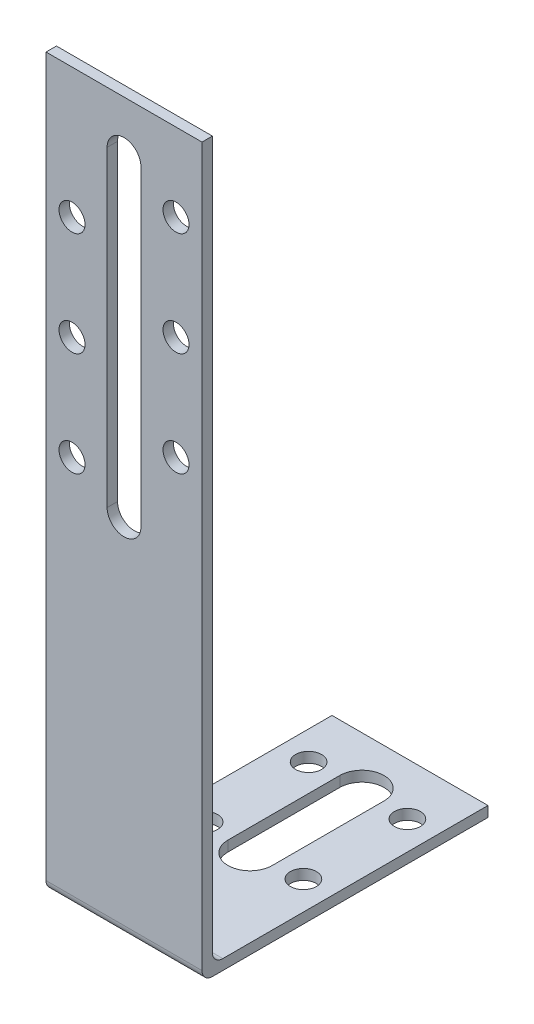
ISO-10303-21;
HEADER;
FILE_DESCRIPTION(('STEP AP214'),'2;1');
FILE_NAME('part.step','',(''),(''),'','','');
FILE_SCHEMA(('AUTOMOTIVE_DESIGN { 1 0 10303 214 1 1 1 1 }'));
ENDSEC;
DATA;
#1=APPLICATION_CONTEXT('core data for automotive mechanical design processes');
#2=APPLICATION_PROTOCOL_DEFINITION('international standard','automotive_design',2000,#1);
#3=PRODUCT_CONTEXT('',#1,'mechanical');
#4=PRODUCT('Part','Part','',(#3));
#5=PRODUCT_RELATED_PRODUCT_CATEGORY('part','',(#4));
#6=PRODUCT_DEFINITION_FORMATION('','',#4);
#7=PRODUCT_DEFINITION_CONTEXT('part definition',#1,'design');
#8=PRODUCT_DEFINITION('design','',#6,#7);
#9=PRODUCT_DEFINITION_SHAPE('','',#8);
#10=(LENGTH_UNIT() NAMED_UNIT(*) SI_UNIT(.MILLI.,.METRE.));
#11=(NAMED_UNIT(*) PLANE_ANGLE_UNIT() SI_UNIT($,.RADIAN.));
#12=(NAMED_UNIT(*) SI_UNIT($,.STERADIAN.) SOLID_ANGLE_UNIT());
#13=UNCERTAINTY_MEASURE_WITH_UNIT(LENGTH_MEASURE(1.E-05),#10,'distance_accuracy_value','');
#14=(GEOMETRIC_REPRESENTATION_CONTEXT(3) GLOBAL_UNCERTAINTY_ASSIGNED_CONTEXT((#13)) GLOBAL_UNIT_ASSIGNED_CONTEXT((#10,
#11,#12)) REPRESENTATION_CONTEXT('',''));
#15=CARTESIAN_POINT('',(0.,0.,0.));
#16=DIRECTION('',(0.,0.,1.));
#17=DIRECTION('',(1.,0.,0.));
#18=AXIS2_PLACEMENT_3D('',#15,#16,#17);
#19=CARTESIAN_POINT('',(15.,0.,-55.));
#20=DIRECTION('',(0.,1.,0.));
#21=DIRECTION('',(0.,0.,1.));
#22=AXIS2_PLACEMENT_3D('',#19,#20,#21);
#23=PLANE('',#22);
#24=CARTESIAN_POINT('',(9.5,0.,-45.));
#25=DIRECTION('',(0.,1.,0.));
#26=DIRECTION('',(0.,0.,1.));
#27=AXIS2_PLACEMENT_3D('',#24,#25,#26);
#28=CIRCLE('',#27,2.5);
#29=CARTESIAN_POINT('',(9.5,0.,-42.5));
#30=VERTEX_POINT('',#29);
#31=EDGE_CURVE('E195',#30,#30,#28,.F.);
#32=ORIENTED_EDGE('',*,*,#31,.F.);
#33=EDGE_LOOP('',(#32));
#34=FACE_BOUND('',#33,.T.);
#35=CARTESIAN_POINT('',(-9.49999999999999,0.,-25.));
#36=DIRECTION('',(0.,1.,0.));
#37=DIRECTION('',(0.,0.,1.));
#38=AXIS2_PLACEMENT_3D('',#35,#36,#37);
#39=CIRCLE('',#38,2.5);
#40=CARTESIAN_POINT('',(-9.49999999999999,0.,-22.5));
#41=VERTEX_POINT('',#40);
#42=EDGE_CURVE('E185',#41,#41,#39,.F.);
#43=ORIENTED_EDGE('',*,*,#42,.F.);
#44=EDGE_LOOP('',(#43));
#45=FACE_BOUND('',#44,.T.);
#46=CARTESIAN_POINT('',(0.,0.,-24.25));
#47=DIRECTION('',(0.,1.,0.));
#48=DIRECTION('',(0.,0.,1.));
#49=AXIS2_PLACEMENT_3D('',#46,#47,#48);
#50=CIRCLE('',#49,4.25);
#51=CARTESIAN_POINT('',(4.25,0.,-24.25));
#52=VERTEX_POINT('',#51);
#53=CARTESIAN_POINT('',(-4.25,0.,-24.25));
#54=VERTEX_POINT('',#53);
#55=EDGE_CURVE('E208',#52,#54,#50,.F.);
#56=ORIENTED_EDGE('',*,*,#55,.F.);
#57=DIRECTION('',(0.,0.,1.));
#58=VECTOR('',#57,1.);
#59=CARTESIAN_POINT('',(4.25,0.,0.));
#60=LINE('',#59,#58);
#61=CARTESIAN_POINT('',(4.25,0.,-45.75));
#62=VERTEX_POINT('',#61);
#63=EDGE_CURVE('E211',#62,#52,#60,.T.);
#64=ORIENTED_EDGE('',*,*,#63,.F.);
#65=CARTESIAN_POINT('',(0.,0.,-45.75));
#66=DIRECTION('',(0.,1.,0.));
#67=DIRECTION('',(0.,0.,1.));
#68=AXIS2_PLACEMENT_3D('',#65,#66,#67);
#69=CIRCLE('',#68,4.25);
#70=CARTESIAN_POINT('',(-4.25,0.,-45.75));
#71=VERTEX_POINT('',#70);
#72=EDGE_CURVE('E228',#71,#62,#69,.F.);
#73=ORIENTED_EDGE('',*,*,#72,.F.);
#74=DIRECTION('',(0.,0.,1.));
#75=VECTOR('',#74,1.);
#76=CARTESIAN_POINT('',(-4.25,0.,0.));
#77=LINE('',#76,#75);
#78=EDGE_CURVE('E189',#71,#54,#77,.T.);
#79=ORIENTED_EDGE('',*,*,#78,.T.);
#80=EDGE_LOOP('',(#56,#64,#73,#79));
#81=FACE_BOUND('',#80,.T.);
#82=DIRECTION('',(0.,0.,-1.));
#83=VECTOR('',#82,1.);
#84=CARTESIAN_POINT('',(15.,0.,-55.));
#85=LINE('',#84,#83);
#86=CARTESIAN_POINT('',(15.,0.,-2.));
#87=VERTEX_POINT('',#86);
#88=CARTESIAN_POINT('',(15.,0.,-55.));
#89=VERTEX_POINT('',#88);
#90=EDGE_CURVE('E238',#87,#89,#85,.T.);
#91=ORIENTED_EDGE('',*,*,#90,.F.);
#92=DIRECTION('',(-1.,0.,0.));
#93=VECTOR('',#92,1.);
#94=CARTESIAN_POINT('',(15.,0.,-2.));
#95=LINE('',#94,#93);
#96=CARTESIAN_POINT('',(-15.,0.,-2.));
#97=VERTEX_POINT('',#96);
#98=EDGE_CURVE('E277',#87,#97,#95,.T.);
#99=ORIENTED_EDGE('',*,*,#98,.T.);
#100=DIRECTION('',(0.,0.,-1.));
#101=VECTOR('',#100,1.);
#102=CARTESIAN_POINT('',(-15.,0.,-55.));
#103=LINE('',#102,#101);
#104=CARTESIAN_POINT('',(-15.,0.,-55.));
#105=VERTEX_POINT('',#104);
#106=EDGE_CURVE('E237',#97,#105,#103,.T.);
#107=ORIENTED_EDGE('',*,*,#106,.T.);
#108=DIRECTION('',(-1.,0.,0.));
#109=VECTOR('',#108,1.);
#110=CARTESIAN_POINT('',(15.,0.,-55.));
#111=LINE('',#110,#109);
#112=EDGE_CURVE('E274',#89,#105,#111,.T.);
#113=ORIENTED_EDGE('',*,*,#112,.F.);
#114=EDGE_LOOP('',(#91,#99,#107,#113));
#115=FACE_BOUND('',#114,.T.);
#116=CARTESIAN_POINT('',(-9.49999999999999,0.,-45.));
#117=DIRECTION('',(0.,1.,0.));
#118=DIRECTION('',(0.,0.,1.));
#119=AXIS2_PLACEMENT_3D('',#116,#117,#118);
#120=CIRCLE('',#119,2.5);
#121=CARTESIAN_POINT('',(-9.49999999999999,0.,-42.5));
#122=VERTEX_POINT('',#121);
#123=EDGE_CURVE('E192',#122,#122,#120,.T.);
#124=ORIENTED_EDGE('',*,*,#123,.T.);
#125=EDGE_LOOP('',(#124));
#126=FACE_BOUND('',#125,.T.);
#127=CARTESIAN_POINT('',(9.5,0.,-25.));
#128=DIRECTION('',(0.,1.,0.));
#129=DIRECTION('',(0.,0.,1.));
#130=AXIS2_PLACEMENT_3D('',#127,#128,#129);
#131=CIRCLE('',#130,2.5);
#132=CARTESIAN_POINT('',(9.5,0.,-22.5));
#133=VERTEX_POINT('',#132);
#134=EDGE_CURVE('E159',#133,#133,#131,.T.);
#135=ORIENTED_EDGE('',*,*,#134,.T.);
#136=EDGE_LOOP('',(#135));
#137=FACE_BOUND('',#136,.T.);
#138=ADVANCED_FACE('F33',(#34,#45,#81,#115,#126,#137),#23,.F.);
#139=CARTESIAN_POINT('',(15.,2.,-2.00000000000001));
#140=DIRECTION('',(0.,-1.,0.));
#141=DIRECTION('',(0.,0.,-1.));
#142=AXIS2_PLACEMENT_3D('',#139,#140,#141);
#143=PLANE('',#142);
#144=CARTESIAN_POINT('',(9.5,2.,-45.));
#145=DIRECTION('',(0.,1.,0.));
#146=DIRECTION('',(0.,0.,1.));
#147=AXIS2_PLACEMENT_3D('',#144,#145,#146);
#148=CIRCLE('',#147,2.5);
#149=CARTESIAN_POINT('',(9.5,2.,-42.5));
#150=VERTEX_POINT('',#149);
#151=EDGE_CURVE('E196',#150,#150,#148,.T.);
#152=ORIENTED_EDGE('',*,*,#151,.F.);
#153=EDGE_LOOP('',(#152));
#154=FACE_BOUND('',#153,.T.);
#155=CARTESIAN_POINT('',(-9.49999999999999,2.,-25.));
#156=DIRECTION('',(0.,1.,0.));
#157=DIRECTION('',(0.,0.,1.));
#158=AXIS2_PLACEMENT_3D('',#155,#156,#157);
#159=CIRCLE('',#158,2.5);
#160=CARTESIAN_POINT('',(-9.49999999999999,2.,-22.5));
#161=VERTEX_POINT('',#160);
#162=EDGE_CURVE('E182',#161,#161,#159,.T.);
#163=ORIENTED_EDGE('',*,*,#162,.F.);
#164=EDGE_LOOP('',(#163));
#165=FACE_BOUND('',#164,.T.);
#166=CARTESIAN_POINT('',(0.,2.,-45.75));
#167=DIRECTION('',(0.,1.,0.));
#168=DIRECTION('',(0.,0.,1.));
#169=AXIS2_PLACEMENT_3D('',#166,#167,#168);
#170=CIRCLE('',#169,4.25);
#171=CARTESIAN_POINT('',(4.25,2.,-45.75));
#172=VERTEX_POINT('',#171);
#173=CARTESIAN_POINT('',(-4.25,2.,-45.75));
#174=VERTEX_POINT('',#173);
#175=EDGE_CURVE('E216',#172,#174,#170,.T.);
#176=ORIENTED_EDGE('',*,*,#175,.F.);
#177=DIRECTION('',(0.,0.,-1.));
#178=VECTOR('',#177,1.);
#179=CARTESIAN_POINT('',(4.25,2.,0.));
#180=LINE('',#179,#178);
#181=CARTESIAN_POINT('',(4.25,2.,-24.25));
#182=VERTEX_POINT('',#181);
#183=EDGE_CURVE('E214',#182,#172,#180,.T.);
#184=ORIENTED_EDGE('',*,*,#183,.F.);
#185=CARTESIAN_POINT('',(0.,2.,-24.25));
#186=DIRECTION('',(0.,1.,0.));
#187=DIRECTION('',(0.,0.,1.));
#188=AXIS2_PLACEMENT_3D('',#185,#186,#187);
#189=CIRCLE('',#188,4.25);
#190=CARTESIAN_POINT('',(-4.25,2.,-24.25));
#191=VERTEX_POINT('',#190);
#192=EDGE_CURVE('E222',#191,#182,#189,.T.);
#193=ORIENTED_EDGE('',*,*,#192,.F.);
#194=DIRECTION('',(0.,0.,-1.));
#195=VECTOR('',#194,1.);
#196=CARTESIAN_POINT('',(-4.25,2.,0.));
#197=LINE('',#196,#195);
#198=EDGE_CURVE('E219',#191,#174,#197,.T.);
#199=ORIENTED_EDGE('',*,*,#198,.T.);
#200=EDGE_LOOP('',(#176,#184,#193,#199));
#201=FACE_BOUND('',#200,.T.);
#202=DIRECTION('',(0.,0.,1.));
#203=VECTOR('',#202,1.);
#204=CARTESIAN_POINT('',(-15.,2.,-2.00000000000001));
#205=LINE('',#204,#203);
#206=CARTESIAN_POINT('',(-15.,2.,-55.));
#207=VERTEX_POINT('',#206);
#208=CARTESIAN_POINT('',(-15.,2.,-4.00000000000001));
#209=VERTEX_POINT('',#208);
#210=EDGE_CURVE('E257',#207,#209,#205,.T.);
#211=ORIENTED_EDGE('',*,*,#210,.T.);
#212=DIRECTION('',(-1.,0.,0.));
#213=VECTOR('',#212,1.);
#214=CARTESIAN_POINT('',(15.,2.,-4.00000000000001));
#215=LINE('',#214,#213);
#216=CARTESIAN_POINT('',(15.,2.,-4.00000000000001));
#217=VERTEX_POINT('',#216);
#218=EDGE_CURVE('E289',#209,#217,#215,.F.);
#219=ORIENTED_EDGE('',*,*,#218,.T.);
#220=DIRECTION('',(0.,0.,1.));
#221=VECTOR('',#220,1.);
#222=CARTESIAN_POINT('',(15.,2.,-2.00000000000001));
#223=LINE('',#222,#221);
#224=CARTESIAN_POINT('',(15.,2.,-55.));
#225=VERTEX_POINT('',#224);
#226=EDGE_CURVE('E243',#225,#217,#223,.T.);
#227=ORIENTED_EDGE('',*,*,#226,.F.);
#228=DIRECTION('',(-1.,0.,0.));
#229=VECTOR('',#228,1.);
#230=CARTESIAN_POINT('',(15.,2.,-55.));
#231=LINE('',#230,#229);
#232=EDGE_CURVE('E271',#225,#207,#231,.T.);
#233=ORIENTED_EDGE('',*,*,#232,.T.);
#234=EDGE_LOOP('',(#211,#219,#227,#233));
#235=FACE_BOUND('',#234,.T.);
#236=CARTESIAN_POINT('',(-9.49999999999999,2.,-45.));
#237=DIRECTION('',(0.,1.,0.));
#238=DIRECTION('',(0.,0.,1.));
#239=AXIS2_PLACEMENT_3D('',#236,#237,#238);
#240=CIRCLE('',#239,2.5);
#241=CARTESIAN_POINT('',(-9.49999999999999,2.,-42.5));
#242=VERTEX_POINT('',#241);
#243=EDGE_CURVE('E186',#242,#242,#240,.F.);
#244=ORIENTED_EDGE('',*,*,#243,.T.);
#245=EDGE_LOOP('',(#244));
#246=FACE_BOUND('',#245,.T.);
#247=CARTESIAN_POINT('',(9.5,2.,-25.));
#248=DIRECTION('',(0.,1.,0.));
#249=DIRECTION('',(0.,0.,1.));
#250=AXIS2_PLACEMENT_3D('',#247,#248,#249);
#251=CIRCLE('',#250,2.5);
#252=CARTESIAN_POINT('',(9.5,2.,-22.5));
#253=VERTEX_POINT('',#252);
#254=EDGE_CURVE('E199',#253,#253,#251,.F.);
#255=ORIENTED_EDGE('',*,*,#254,.T.);
#256=EDGE_LOOP('',(#255));
#257=FACE_BOUND('',#256,.T.);
#258=ADVANCED_FACE('F301',(#154,#165,#201,#235,#246,#257),#143,.F.);
#259=CARTESIAN_POINT('',(15.,2.,-55.));
#260=DIRECTION('',(0.,0.,1.));
#261=DIRECTION('',(1.,0.,0.));
#262=AXIS2_PLACEMENT_3D('',#259,#260,#261);
#263=PLANE('',#262);
#264=DIRECTION('',(0.,1.,0.));
#265=VECTOR('',#264,1.);
#266=CARTESIAN_POINT('',(-15.,2.,-55.));
#267=LINE('',#266,#265);
#268=EDGE_CURVE('E255',#105,#207,#267,.T.);
#269=ORIENTED_EDGE('',*,*,#268,.T.);
#270=ORIENTED_EDGE('',*,*,#232,.F.);
#271=DIRECTION('',(0.,1.,0.));
#272=VECTOR('',#271,1.);
#273=CARTESIAN_POINT('',(15.,2.,-55.));
#274=LINE('',#273,#272);
#275=EDGE_CURVE('E240',#89,#225,#274,.T.);
#276=ORIENTED_EDGE('',*,*,#275,.F.);
#277=ORIENTED_EDGE('',*,*,#112,.T.);
#278=EDGE_LOOP('',(#269,#270,#276,#277));
#279=FACE_BOUND('',#278,.T.);
#280=ADVANCED_FACE('F329',(#279),#263,.F.);
#281=CARTESIAN_POINT('',(15.,140.,-2.));
#282=DIRECTION('',(0.,0.,1.));
#283=DIRECTION('',(0.,-1.,0.));
#284=AXIS2_PLACEMENT_3D('',#281,#282,#283);
#285=PLANE('',#284);
#286=CARTESIAN_POINT('',(-10.,115.,-2.));
#287=DIRECTION('',(0.,0.,-1.));
#288=DIRECTION('',(0.,1.,0.));
#289=AXIS2_PLACEMENT_3D('',#286,#287,#288);
#290=CIRCLE('',#289,2.5);
#291=CARTESIAN_POINT('',(-10.,117.5,-2.));
#292=VERTEX_POINT('',#291);
#293=EDGE_CURVE('E594',#292,#292,#290,.T.);
#294=ORIENTED_EDGE('',*,*,#293,.F.);
#295=EDGE_LOOP('',(#294));
#296=FACE_BOUND('',#295,.T.);
#297=CARTESIAN_POINT('',(10.,85.,-2.));
#298=DIRECTION('',(0.,0.,-1.));
#299=DIRECTION('',(0.,1.,0.));
#300=AXIS2_PLACEMENT_3D('',#297,#298,#299);
#301=CIRCLE('',#300,2.5);
#302=CARTESIAN_POINT('',(10.,87.5,-2.));
#303=VERTEX_POINT('',#302);
#304=EDGE_CURVE('E598',#303,#303,#301,.T.);
#305=ORIENTED_EDGE('',*,*,#304,.F.);
#306=EDGE_LOOP('',(#305));
#307=FACE_BOUND('',#306,.T.);
#308=CARTESIAN_POINT('',(10.,105.,-2.));
#309=DIRECTION('',(0.,0.,-1.));
#310=DIRECTION('',(0.,1.,0.));
#311=AXIS2_PLACEMENT_3D('',#308,#309,#310);
#312=CIRCLE('',#311,2.5);
#313=CARTESIAN_POINT('',(10.,107.5,-2.));
#314=VERTEX_POINT('',#313);
#315=EDGE_CURVE('E614',#314,#314,#312,.T.);
#316=ORIENTED_EDGE('',*,*,#315,.F.);
#317=EDGE_LOOP('',(#316));
#318=FACE_BOUND('',#317,.T.);
#319=CARTESIAN_POINT('',(10.,125.,-2.));
#320=DIRECTION('',(0.,0.,-1.));
#321=DIRECTION('',(0.,1.,0.));
#322=AXIS2_PLACEMENT_3D('',#319,#320,#321);
#323=CIRCLE('',#322,2.5);
#324=CARTESIAN_POINT('',(10.,127.5,-2.));
#325=VERTEX_POINT('',#324);
#326=EDGE_CURVE('E607',#325,#325,#323,.T.);
#327=ORIENTED_EDGE('',*,*,#326,.F.);
#328=EDGE_LOOP('',(#327));
#329=FACE_BOUND('',#328,.T.);
#330=CARTESIAN_POINT('',(-10.,95.,-2.));
#331=DIRECTION('',(0.,0.,-1.));
#332=DIRECTION('',(0.,1.,0.));
#333=AXIS2_PLACEMENT_3D('',#330,#331,#332);
#334=CIRCLE('',#333,2.5);
#335=CARTESIAN_POINT('',(-10.,97.5,-2.));
#336=VERTEX_POINT('',#335);
#337=EDGE_CURVE('E631',#336,#336,#334,.T.);
#338=ORIENTED_EDGE('',*,*,#337,.F.);
#339=EDGE_LOOP('',(#338));
#340=FACE_BOUND('',#339,.T.);
#341=CARTESIAN_POINT('',(-10.,75.,-2.));
#342=DIRECTION('',(0.,0.,-1.));
#343=DIRECTION('',(0.,1.,0.));
#344=AXIS2_PLACEMENT_3D('',#341,#342,#343);
#345=CIRCLE('',#344,2.5);
#346=CARTESIAN_POINT('',(-10.,77.5,-2.));
#347=VERTEX_POINT('',#346);
#348=EDGE_CURVE('E632',#347,#347,#345,.T.);
#349=ORIENTED_EDGE('',*,*,#348,.F.);
#350=EDGE_LOOP('',(#349));
#351=FACE_BOUND('',#350,.T.);
#352=DIRECTION('',(0.,-1.,0.));
#353=VECTOR('',#352,1.);
#354=CARTESIAN_POINT('',(3.25,130.,-2.));
#355=LINE('',#354,#353);
#356=CARTESIAN_POINT('',(3.25,130.,-2.));
#357=VERTEX_POINT('',#356);
#358=CARTESIAN_POINT('',(3.25,70.,-2.));
#359=VERTEX_POINT('',#358);
#360=EDGE_CURVE('E167',#357,#359,#355,.T.);
#361=ORIENTED_EDGE('',*,*,#360,.F.);
#362=CARTESIAN_POINT('',(0.,130.,-2.));
#363=DIRECTION('',(0.,0.,-1.));
#364=DIRECTION('',(0.,1.,0.));
#365=AXIS2_PLACEMENT_3D('',#362,#363,#364);
#366=CIRCLE('',#365,3.25);
#367=CARTESIAN_POINT('',(-3.24999999999999,130.,-2.));
#368=VERTEX_POINT('',#367);
#369=EDGE_CURVE('E48',#368,#357,#366,.T.);
#370=ORIENTED_EDGE('',*,*,#369,.F.);
#371=DIRECTION('',(0.,1.,0.));
#372=VECTOR('',#371,1.);
#373=CARTESIAN_POINT('',(-3.24999999999999,130.,-2.));
#374=LINE('',#373,#372);
#375=CARTESIAN_POINT('',(-3.25,70.,-2.));
#376=VERTEX_POINT('',#375);
#377=EDGE_CURVE('E153',#376,#368,#374,.T.);
#378=ORIENTED_EDGE('',*,*,#377,.F.);
#379=CARTESIAN_POINT('',(0.,70.,-2.));
#380=DIRECTION('',(0.,0.,-1.));
#381=DIRECTION('',(0.,1.,0.));
#382=AXIS2_PLACEMENT_3D('',#379,#380,#381);
#383=CIRCLE('',#382,3.25);
#384=EDGE_CURVE('E173',#359,#376,#383,.T.);
#385=ORIENTED_EDGE('',*,*,#384,.F.);
#386=EDGE_LOOP('',(#361,#370,#378,#385));
#387=FACE_BOUND('',#386,.T.);
#388=DIRECTION('',(0.,1.,0.));
#389=VECTOR('',#388,1.);
#390=CARTESIAN_POINT('',(15.,140.,-2.));
#391=LINE('',#390,#389);
#392=CARTESIAN_POINT('',(15.,4.,-2.00000000000001));
#393=VERTEX_POINT('',#392);
#394=CARTESIAN_POINT('',(15.,140.,-2.));
#395=VERTEX_POINT('',#394);
#396=EDGE_CURVE('E246',#393,#395,#391,.T.);
#397=ORIENTED_EDGE('',*,*,#396,.F.);
#398=DIRECTION('',(-1.,0.,0.));
#399=VECTOR('',#398,1.);
#400=CARTESIAN_POINT('',(-15.,4.,-2.00000000000001));
#401=LINE('',#400,#399);
#402=CARTESIAN_POINT('',(-15.,4.,-2.00000000000001));
#403=VERTEX_POINT('',#402);
#404=EDGE_CURVE('E286',#393,#403,#401,.T.);
#405=ORIENTED_EDGE('',*,*,#404,.T.);
#406=DIRECTION('',(0.,1.,0.));
#407=VECTOR('',#406,1.);
#408=CARTESIAN_POINT('',(-15.,140.,-2.));
#409=LINE('',#408,#407);
#410=CARTESIAN_POINT('',(-15.,140.,-2.));
#411=VERTEX_POINT('',#410);
#412=EDGE_CURVE('E260',#403,#411,#409,.T.);
#413=ORIENTED_EDGE('',*,*,#412,.T.);
#414=DIRECTION('',(-1.,0.,0.));
#415=VECTOR('',#414,1.);
#416=CARTESIAN_POINT('',(15.,140.,-2.));
#417=LINE('',#416,#415);
#418=EDGE_CURVE('E268',#395,#411,#417,.T.);
#419=ORIENTED_EDGE('',*,*,#418,.F.);
#420=EDGE_LOOP('',(#397,#405,#413,#419));
#421=FACE_BOUND('',#420,.T.);
#422=ADVANCED_FACE('F311',(#296,#307,#318,#329,#340,#351,#387,#421),#285,.F.);
#423=CARTESIAN_POINT('',(15.,140.,0.));
#424=DIRECTION('',(0.,-1.,0.));
#425=DIRECTION('',(0.,0.,-1.));
#426=AXIS2_PLACEMENT_3D('',#423,#424,#425);
#427=PLANE('',#426);
#428=DIRECTION('',(0.,0.,1.));
#429=VECTOR('',#428,1.);
#430=CARTESIAN_POINT('',(-15.,140.,0.));
#431=LINE('',#430,#429);
#432=CARTESIAN_POINT('',(-15.,140.,0.));
#433=VERTEX_POINT('',#432);
#434=EDGE_CURVE('E262',#411,#433,#431,.T.);
#435=ORIENTED_EDGE('',*,*,#434,.T.);
#436=DIRECTION('',(-1.,0.,0.));
#437=VECTOR('',#436,1.);
#438=CARTESIAN_POINT('',(15.,140.,0.));
#439=LINE('',#438,#437);
#440=CARTESIAN_POINT('',(15.,140.,0.));
#441=VERTEX_POINT('',#440);
#442=EDGE_CURVE('E253',#441,#433,#439,.T.);
#443=ORIENTED_EDGE('',*,*,#442,.F.);
#444=DIRECTION('',(0.,0.,1.));
#445=VECTOR('',#444,1.);
#446=CARTESIAN_POINT('',(15.,140.,0.));
#447=LINE('',#446,#445);
#448=EDGE_CURVE('E248',#395,#441,#447,.T.);
#449=ORIENTED_EDGE('',*,*,#448,.F.);
#450=ORIENTED_EDGE('',*,*,#418,.T.);
#451=EDGE_LOOP('',(#435,#443,#449,#450));
#452=FACE_BOUND('',#451,.T.);
#453=ADVANCED_FACE('F315',(#452),#427,.F.);
#454=CARTESIAN_POINT('',(15.,0.,0.));
#455=DIRECTION('',(0.,0.,-1.));
#456=DIRECTION('',(-1.,0.,0.));
#457=AXIS2_PLACEMENT_3D('',#454,#455,#456);
#458=PLANE('',#457);
#459=CARTESIAN_POINT('',(-10.,115.,0.));
#460=DIRECTION('',(0.,0.,-1.));
#461=DIRECTION('',(-1.,0.,0.));
#462=AXIS2_PLACEMENT_3D('',#459,#460,#461);
#463=CIRCLE('',#462,2.5);
#464=CARTESIAN_POINT('',(-12.5,115.,0.));
#465=VERTEX_POINT('',#464);
#466=EDGE_CURVE('E597',#465,#465,#463,.F.);
#467=ORIENTED_EDGE('',*,*,#466,.F.);
#468=EDGE_LOOP('',(#467));
#469=FACE_BOUND('',#468,.T.);
#470=CARTESIAN_POINT('',(10.,85.,0.));
#471=DIRECTION('',(0.,0.,-1.));
#472=DIRECTION('',(-1.,0.,0.));
#473=AXIS2_PLACEMENT_3D('',#470,#471,#472);
#474=CIRCLE('',#473,2.5);
#475=CARTESIAN_POINT('',(7.5,85.,0.));
#476=VERTEX_POINT('',#475);
#477=EDGE_CURVE('E601',#476,#476,#474,.F.);
#478=ORIENTED_EDGE('',*,*,#477,.F.);
#479=EDGE_LOOP('',(#478));
#480=FACE_BOUND('',#479,.T.);
#481=CARTESIAN_POINT('',(10.,105.,0.));
#482=DIRECTION('',(0.,0.,-1.));
#483=DIRECTION('',(-1.,0.,0.));
#484=AXIS2_PLACEMENT_3D('',#481,#482,#483);
#485=CIRCLE('',#484,2.5);
#486=CARTESIAN_POINT('',(7.5,105.,0.));
#487=VERTEX_POINT('',#486);
#488=EDGE_CURVE('E611',#487,#487,#485,.F.);
#489=ORIENTED_EDGE('',*,*,#488,.F.);
#490=EDGE_LOOP('',(#489));
#491=FACE_BOUND('',#490,.T.);
#492=CARTESIAN_POINT('',(10.,125.,0.));
#493=DIRECTION('',(0.,0.,-1.));
#494=DIRECTION('',(-1.,0.,0.));
#495=AXIS2_PLACEMENT_3D('',#492,#493,#494);
#496=CIRCLE('',#495,2.5);
#497=CARTESIAN_POINT('',(7.5,125.,0.));
#498=VERTEX_POINT('',#497);
#499=EDGE_CURVE('E610',#498,#498,#496,.F.);
#500=ORIENTED_EDGE('',*,*,#499,.F.);
#501=EDGE_LOOP('',(#500));
#502=FACE_BOUND('',#501,.T.);
#503=CARTESIAN_POINT('',(-10.,95.,0.));
#504=DIRECTION('',(0.,0.,-1.));
#505=DIRECTION('',(-1.,0.,0.));
#506=AXIS2_PLACEMENT_3D('',#503,#504,#505);
#507=CIRCLE('',#506,2.5);
#508=CARTESIAN_POINT('',(-12.5,95.,0.));
#509=VERTEX_POINT('',#508);
#510=EDGE_CURVE('E603',#509,#509,#507,.F.);
#511=ORIENTED_EDGE('',*,*,#510,.F.);
#512=EDGE_LOOP('',(#511));
#513=FACE_BOUND('',#512,.T.);
#514=CARTESIAN_POINT('',(-10.,75.,0.));
#515=DIRECTION('',(0.,0.,-1.));
#516=DIRECTION('',(-1.,0.,0.));
#517=AXIS2_PLACEMENT_3D('',#514,#515,#516);
#518=CIRCLE('',#517,2.5);
#519=CARTESIAN_POINT('',(-12.5,75.,0.));
#520=VERTEX_POINT('',#519);
#521=EDGE_CURVE('E629',#520,#520,#518,.F.);
#522=ORIENTED_EDGE('',*,*,#521,.F.);
#523=EDGE_LOOP('',(#522));
#524=FACE_BOUND('',#523,.T.);
#525=DIRECTION('',(0.,-1.,0.));
#526=VECTOR('',#525,1.);
#527=CARTESIAN_POINT('',(-3.24999999999999,130.,0.));
#528=LINE('',#527,#526);
#529=CARTESIAN_POINT('',(-3.24999999999999,130.,0.));
#530=VERTEX_POINT('',#529);
#531=CARTESIAN_POINT('',(-3.25,70.,0.));
#532=VERTEX_POINT('',#531);
#533=EDGE_CURVE('E165',#530,#532,#528,.T.);
#534=ORIENTED_EDGE('',*,*,#533,.F.);
#535=CARTESIAN_POINT('',(0.,130.,0.));
#536=DIRECTION('',(0.,0.,-1.));
#537=DIRECTION('',(-1.,0.,0.));
#538=AXIS2_PLACEMENT_3D('',#535,#536,#537);
#539=CIRCLE('',#538,3.25);
#540=CARTESIAN_POINT('',(3.25,130.,0.));
#541=VERTEX_POINT('',#540);
#542=EDGE_CURVE('E147',#541,#530,#539,.F.);
#543=ORIENTED_EDGE('',*,*,#542,.F.);
#544=DIRECTION('',(0.,1.,0.));
#545=VECTOR('',#544,1.);
#546=CARTESIAN_POINT('',(3.25,130.,0.));
#547=LINE('',#546,#545);
#548=CARTESIAN_POINT('',(3.25,70.,0.));
#549=VERTEX_POINT('',#548);
#550=EDGE_CURVE('E156',#549,#541,#547,.T.);
#551=ORIENTED_EDGE('',*,*,#550,.F.);
#552=CARTESIAN_POINT('',(0.,70.,0.));
#553=DIRECTION('',(0.,0.,-1.));
#554=DIRECTION('',(-1.,0.,0.));
#555=AXIS2_PLACEMENT_3D('',#552,#553,#554);
#556=CIRCLE('',#555,3.25);
#557=EDGE_CURVE('E56',#532,#549,#556,.F.);
#558=ORIENTED_EDGE('',*,*,#557,.F.);
#559=EDGE_LOOP('',(#534,#543,#551,#558));
#560=FACE_BOUND('',#559,.T.);
#561=DIRECTION('',(0.,-1.,0.));
#562=VECTOR('',#561,1.);
#563=CARTESIAN_POINT('',(-15.,0.,0.));
#564=LINE('',#563,#562);
#565=CARTESIAN_POINT('',(-15.,2.,0.));
#566=VERTEX_POINT('',#565);
#567=EDGE_CURVE('E241',#433,#566,#564,.T.);
#568=ORIENTED_EDGE('',*,*,#567,.T.);
#569=DIRECTION('',(-1.,0.,0.));
#570=VECTOR('',#569,1.);
#571=CARTESIAN_POINT('',(15.,2.,0.));
#572=LINE('',#571,#570);
#573=CARTESIAN_POINT('',(15.,2.,0.));
#574=VERTEX_POINT('',#573);
#575=EDGE_CURVE('E282',#566,#574,#572,.F.);
#576=ORIENTED_EDGE('',*,*,#575,.T.);
#577=DIRECTION('',(0.,-1.,0.));
#578=VECTOR('',#577,1.);
#579=CARTESIAN_POINT('',(15.,0.,0.));
#580=LINE('',#579,#578);
#581=EDGE_CURVE('E250',#441,#574,#580,.T.);
#582=ORIENTED_EDGE('',*,*,#581,.F.);
#583=ORIENTED_EDGE('',*,*,#442,.T.);
#584=EDGE_LOOP('',(#568,#576,#582,#583));
#585=FACE_BOUND('',#584,.T.);
#586=ADVANCED_FACE('F162',(#469,#480,#491,#502,#513,#524,#560,#585),#458,.F.);
#587=CARTESIAN_POINT('',(15.,0.,0.));
#588=DIRECTION('',(-1.,0.,0.));
#589=DIRECTION('',(0.,0.,1.));
#590=AXIS2_PLACEMENT_3D('',#587,#588,#589);
#591=PLANE('',#590);
#592=ORIENTED_EDGE('',*,*,#581,.T.);
#593=CARTESIAN_POINT('',(15.,2.,-2.));
#594=DIRECTION('',(-1.,0.,0.));
#595=DIRECTION('',(0.,0.,1.));
#596=AXIS2_PLACEMENT_3D('',#593,#594,#595);
#597=CIRCLE('',#596,2.);
#598=EDGE_CURVE('E284',#574,#87,#597,.F.);
#599=ORIENTED_EDGE('',*,*,#598,.T.);
#600=ORIENTED_EDGE('',*,*,#90,.T.);
#601=ORIENTED_EDGE('',*,*,#275,.T.);
#602=ORIENTED_EDGE('',*,*,#226,.T.);
#603=CARTESIAN_POINT('',(15.,4.,-4.00000000000001));
#604=DIRECTION('',(-1.,0.,0.));
#605=DIRECTION('',(0.,0.,1.));
#606=AXIS2_PLACEMENT_3D('',#603,#604,#605);
#607=CIRCLE('',#606,2.);
#608=EDGE_CURVE('E11',#217,#393,#607,.T.);
#609=ORIENTED_EDGE('',*,*,#608,.T.);
#610=ORIENTED_EDGE('',*,*,#396,.T.);
#611=ORIENTED_EDGE('',*,*,#448,.T.);
#612=EDGE_LOOP('',(#592,#599,#600,#601,#602,#609,#610,#611));
#613=FACE_BOUND('',#612,.T.);
#614=ADVANCED_FACE('F308',(#613),#591,.F.);
#615=CARTESIAN_POINT('',(-15.,0.,0.));
#616=DIRECTION('',(-1.,0.,0.));
#617=DIRECTION('',(0.,0.,1.));
#618=AXIS2_PLACEMENT_3D('',#615,#616,#617);
#619=PLANE('',#618);
#620=ORIENTED_EDGE('',*,*,#106,.F.);
#621=CARTESIAN_POINT('',(-15.,2.,-2.));
#622=DIRECTION('',(-1.,0.,0.));
#623=DIRECTION('',(0.,0.,1.));
#624=AXIS2_PLACEMENT_3D('',#621,#622,#623);
#625=CIRCLE('',#624,2.);
#626=EDGE_CURVE('E280',#97,#566,#625,.T.);
#627=ORIENTED_EDGE('',*,*,#626,.T.);
#628=ORIENTED_EDGE('',*,*,#567,.F.);
#629=ORIENTED_EDGE('',*,*,#434,.F.);
#630=ORIENTED_EDGE('',*,*,#412,.F.);
#631=CARTESIAN_POINT('',(-15.,4.,-4.00000000000001));
#632=DIRECTION('',(-1.,0.,0.));
#633=DIRECTION('',(0.,0.,1.));
#634=AXIS2_PLACEMENT_3D('',#631,#632,#633);
#635=CIRCLE('',#634,2.);
#636=EDGE_CURVE('E41',#403,#209,#635,.F.);
#637=ORIENTED_EDGE('',*,*,#636,.T.);
#638=ORIENTED_EDGE('',*,*,#210,.F.);
#639=ORIENTED_EDGE('',*,*,#268,.F.);
#640=EDGE_LOOP('',(#620,#627,#628,#629,#630,#637,#638,#639));
#641=FACE_BOUND('',#640,.T.);
#642=ADVANCED_FACE('F294',(#641),#619,.T.);
#643=CARTESIAN_POINT('',(15.,2.,-2.));
#644=DIRECTION('',(-1.,0.,0.));
#645=DIRECTION('',(0.,0.,1.));
#646=AXIS2_PLACEMENT_3D('',#643,#644,#645);
#647=CYLINDRICAL_SURFACE('',#646,2.);
#648=ORIENTED_EDGE('',*,*,#598,.F.);
#649=ORIENTED_EDGE('',*,*,#575,.F.);
#650=ORIENTED_EDGE('',*,*,#626,.F.);
#651=ORIENTED_EDGE('',*,*,#98,.F.);
#652=EDGE_LOOP('',(#648,#649,#650,#651));
#653=FACE_BOUND('',#652,.T.);
#654=ADVANCED_FACE('F322',(#653),#647,.T.);
#655=CARTESIAN_POINT('',(15.,4.,-4.00000000000001));
#656=DIRECTION('',(1.,0.,0.));
#657=DIRECTION('',(0.,0.,-1.));
#658=AXIS2_PLACEMENT_3D('',#655,#656,#657);
#659=CYLINDRICAL_SURFACE('',#658,2.);
#660=ORIENTED_EDGE('',*,*,#608,.F.);
#661=ORIENTED_EDGE('',*,*,#218,.F.);
#662=ORIENTED_EDGE('',*,*,#636,.F.);
#663=ORIENTED_EDGE('',*,*,#404,.F.);
#664=EDGE_LOOP('',(#660,#661,#662,#663));
#665=FACE_BOUND('',#664,.T.);
#666=ADVANCED_FACE('F35',(#665),#659,.F.);
#667=CARTESIAN_POINT('',(4.25,-0.00100000000000317,0.));
#668=DIRECTION('',(1.,0.,0.));
#669=DIRECTION('',(0.,0.,-1.));
#670=AXIS2_PLACEMENT_3D('',#667,#668,#669);
#671=PLANE('',#670);
#672=ORIENTED_EDGE('',*,*,#63,.T.);
#673=DIRECTION('',(0.,1.,0.));
#674=VECTOR('',#673,1.);
#675=CARTESIAN_POINT('',(4.25,-0.00100000000000187,-24.25));
#676=LINE('',#675,#674);
#677=EDGE_CURVE('E226',#52,#182,#676,.T.);
#678=ORIENTED_EDGE('',*,*,#677,.T.);
#679=ORIENTED_EDGE('',*,*,#183,.T.);
#680=DIRECTION('',(0.,1.,0.));
#681=VECTOR('',#680,1.);
#682=CARTESIAN_POINT('',(4.25,-0.00100000000000057,-45.75));
#683=LINE('',#682,#681);
#684=EDGE_CURVE('E225',#62,#172,#683,.T.);
#685=ORIENTED_EDGE('',*,*,#684,.F.);
#686=EDGE_LOOP('',(#672,#678,#679,#685));
#687=FACE_BOUND('',#686,.T.);
#688=ADVANCED_FACE('F352',(#687),#671,.F.);
#689=CARTESIAN_POINT('',(0.,-0.00100000000000187,-24.25));
#690=DIRECTION('',(0.,1.,0.));
#691=DIRECTION('',(0.,0.,1.));
#692=AXIS2_PLACEMENT_3D('',#689,#690,#691);
#693=CYLINDRICAL_SURFACE('',#692,4.25);
#694=ORIENTED_EDGE('',*,*,#55,.T.);
#695=DIRECTION('',(0.,1.,0.));
#696=VECTOR('',#695,1.);
#697=CARTESIAN_POINT('',(-4.25,-0.00100000000000187,-24.25));
#698=LINE('',#697,#696);
#699=EDGE_CURVE('E229',#54,#191,#698,.T.);
#700=ORIENTED_EDGE('',*,*,#699,.T.);
#701=ORIENTED_EDGE('',*,*,#192,.T.);
#702=ORIENTED_EDGE('',*,*,#677,.F.);
#703=EDGE_LOOP('',(#694,#700,#701,#702));
#704=FACE_BOUND('',#703,.T.);
#705=ADVANCED_FACE('F410',(#704),#693,.F.);
#706=CARTESIAN_POINT('',(-4.25,-0.00100000000000317,0.));
#707=DIRECTION('',(1.,0.,0.));
#708=DIRECTION('',(0.,0.,-1.));
#709=AXIS2_PLACEMENT_3D('',#706,#707,#708);
#710=PLANE('',#709);
#711=DIRECTION('',(0.,1.,0.));
#712=VECTOR('',#711,1.);
#713=CARTESIAN_POINT('',(-4.25,-0.00100000000000057,-45.75));
#714=LINE('',#713,#712);
#715=EDGE_CURVE('E231',#71,#174,#714,.T.);
#716=ORIENTED_EDGE('',*,*,#715,.T.);
#717=ORIENTED_EDGE('',*,*,#198,.F.);
#718=ORIENTED_EDGE('',*,*,#699,.F.);
#719=ORIENTED_EDGE('',*,*,#78,.F.);
#720=EDGE_LOOP('',(#716,#717,#718,#719));
#721=FACE_BOUND('',#720,.T.);
#722=ADVANCED_FACE('F419',(#721),#710,.T.);
#723=CARTESIAN_POINT('',(0.,-0.00100000000000057,-45.75));
#724=DIRECTION('',(0.,1.,0.));
#725=DIRECTION('',(0.,0.,1.));
#726=AXIS2_PLACEMENT_3D('',#723,#724,#725);
#727=CYLINDRICAL_SURFACE('',#726,4.25);
#728=ORIENTED_EDGE('',*,*,#72,.T.);
#729=ORIENTED_EDGE('',*,*,#684,.T.);
#730=ORIENTED_EDGE('',*,*,#175,.T.);
#731=ORIENTED_EDGE('',*,*,#715,.F.);
#732=EDGE_LOOP('',(#728,#729,#730,#731));
#733=FACE_BOUND('',#732,.T.);
#734=ADVANCED_FACE('F429',(#733),#727,.F.);
#735=CARTESIAN_POINT('',(-9.49999999999999,-0.00100000000000187,-25.));
#736=DIRECTION('',(0.,1.,0.));
#737=DIRECTION('',(0.,0.,1.));
#738=AXIS2_PLACEMENT_3D('',#735,#736,#737);
#739=CYLINDRICAL_SURFACE('',#738,2.5);
#740=ORIENTED_EDGE('',*,*,#162,.T.);
#741=EDGE_LOOP('',(#740));
#742=FACE_BOUND('',#741,.T.);
#743=ORIENTED_EDGE('',*,*,#42,.T.);
#744=EDGE_LOOP('',(#743));
#745=FACE_BOUND('',#744,.T.);
#746=ADVANCED_FACE('F439',(#742,#745),#739,.F.);
#747=CARTESIAN_POINT('',(-9.49999999999999,-0.00100000000000057,-45.));
#748=DIRECTION('',(0.,1.,0.));
#749=DIRECTION('',(0.,0.,1.));
#750=AXIS2_PLACEMENT_3D('',#747,#748,#749);
#751=CYLINDRICAL_SURFACE('',#750,2.5);
#752=ORIENTED_EDGE('',*,*,#243,.F.);
#753=EDGE_LOOP('',(#752));
#754=FACE_BOUND('',#753,.T.);
#755=ORIENTED_EDGE('',*,*,#123,.F.);
#756=EDGE_LOOP('',(#755));
#757=FACE_BOUND('',#756,.T.);
#758=ADVANCED_FACE('F449',(#754,#757),#751,.F.);
#759=CARTESIAN_POINT('',(9.5,-0.00100000000000057,-45.));
#760=DIRECTION('',(0.,1.,0.));
#761=DIRECTION('',(0.,0.,1.));
#762=AXIS2_PLACEMENT_3D('',#759,#760,#761);
#763=CYLINDRICAL_SURFACE('',#762,2.5);
#764=ORIENTED_EDGE('',*,*,#151,.T.);
#765=EDGE_LOOP('',(#764));
#766=FACE_BOUND('',#765,.T.);
#767=ORIENTED_EDGE('',*,*,#31,.T.);
#768=EDGE_LOOP('',(#767));
#769=FACE_BOUND('',#768,.T.);
#770=ADVANCED_FACE('F459',(#766,#769),#763,.F.);
#771=CARTESIAN_POINT('',(9.5,-0.00100000000000187,-25.));
#772=DIRECTION('',(0.,1.,0.));
#773=DIRECTION('',(0.,0.,1.));
#774=AXIS2_PLACEMENT_3D('',#771,#772,#773);
#775=CYLINDRICAL_SURFACE('',#774,2.5);
#776=ORIENTED_EDGE('',*,*,#254,.F.);
#777=EDGE_LOOP('',(#776));
#778=FACE_BOUND('',#777,.T.);
#779=ORIENTED_EDGE('',*,*,#134,.F.);
#780=EDGE_LOOP('',(#779));
#781=FACE_BOUND('',#780,.T.);
#782=ADVANCED_FACE('F470',(#778,#781),#775,.F.);
#783=CARTESIAN_POINT('',(0.,130.,0.00100000000001575));
#784=DIRECTION('',(0.,0.,-1.));
#785=DIRECTION('',(0.,1.,0.));
#786=AXIS2_PLACEMENT_3D('',#783,#784,#785);
#787=CYLINDRICAL_SURFACE('',#786,3.25);
#788=ORIENTED_EDGE('',*,*,#542,.T.);
#789=DIRECTION('',(0.,0.,-1.));
#790=VECTOR('',#789,1.);
#791=CARTESIAN_POINT('',(-3.24999999999999,130.,0.00100000000001575));
#792=LINE('',#791,#790);
#793=EDGE_CURVE('E160',#530,#368,#792,.T.);
#794=ORIENTED_EDGE('',*,*,#793,.T.);
#795=ORIENTED_EDGE('',*,*,#369,.T.);
#796=DIRECTION('',(0.,0.,-1.));
#797=VECTOR('',#796,1.);
#798=CARTESIAN_POINT('',(3.25,130.,0.00100000000001575));
#799=LINE('',#798,#797);
#800=EDGE_CURVE('E143',#541,#357,#799,.T.);
#801=ORIENTED_EDGE('',*,*,#800,.F.);
#802=EDGE_LOOP('',(#788,#794,#795,#801));
#803=FACE_BOUND('',#802,.T.);
#804=ADVANCED_FACE('F145',(#803),#787,.F.);
#805=CARTESIAN_POINT('',(-3.24999999999999,130.,0.00100000000001575));
#806=DIRECTION('',(-1.,0.,0.));
#807=DIRECTION('',(0.,-1.,0.));
#808=AXIS2_PLACEMENT_3D('',#805,#806,#807);
#809=PLANE('',#808);
#810=ORIENTED_EDGE('',*,*,#533,.T.);
#811=DIRECTION('',(0.,0.,-1.));
#812=VECTOR('',#811,1.);
#813=CARTESIAN_POINT('',(-3.25,70.,0.00100000000000837));
#814=LINE('',#813,#812);
#815=EDGE_CURVE('E179',#532,#376,#814,.T.);
#816=ORIENTED_EDGE('',*,*,#815,.T.);
#817=ORIENTED_EDGE('',*,*,#377,.T.);
#818=ORIENTED_EDGE('',*,*,#793,.F.);
#819=EDGE_LOOP('',(#810,#816,#817,#818));
#820=FACE_BOUND('',#819,.T.);
#821=ADVANCED_FACE('F501',(#820),#809,.F.);
#822=CARTESIAN_POINT('',(0.,70.,0.00100000000000837));
#823=DIRECTION('',(0.,0.,-1.));
#824=DIRECTION('',(0.,1.,0.));
#825=AXIS2_PLACEMENT_3D('',#822,#823,#824);
#826=CYLINDRICAL_SURFACE('',#825,3.25);
#827=ORIENTED_EDGE('',*,*,#557,.T.);
#828=DIRECTION('',(0.,0.,-1.));
#829=VECTOR('',#828,1.);
#830=CARTESIAN_POINT('',(3.25,70.,0.00100000000000837));
#831=LINE('',#830,#829);
#832=EDGE_CURVE('E152',#549,#359,#831,.T.);
#833=ORIENTED_EDGE('',*,*,#832,.T.);
#834=ORIENTED_EDGE('',*,*,#384,.T.);
#835=ORIENTED_EDGE('',*,*,#815,.F.);
#836=EDGE_LOOP('',(#827,#833,#834,#835));
#837=FACE_BOUND('',#836,.T.);
#838=ADVANCED_FACE('F507',(#837),#826,.F.);
#839=CARTESIAN_POINT('',(3.25,130.,0.00100000000001575));
#840=DIRECTION('',(1.,0.,0.));
#841=DIRECTION('',(0.,1.,0.));
#842=AXIS2_PLACEMENT_3D('',#839,#840,#841);
#843=PLANE('',#842);
#844=ORIENTED_EDGE('',*,*,#550,.T.);
#845=ORIENTED_EDGE('',*,*,#800,.T.);
#846=ORIENTED_EDGE('',*,*,#360,.T.);
#847=ORIENTED_EDGE('',*,*,#832,.F.);
#848=EDGE_LOOP('',(#844,#845,#846,#847));
#849=FACE_BOUND('',#848,.T.);
#850=ADVANCED_FACE('F157',(#849),#843,.F.);
#851=CARTESIAN_POINT('',(-10.,75.,0.00100000000000924));
#852=DIRECTION('',(0.,0.,-1.));
#853=DIRECTION('',(0.,1.,0.));
#854=AXIS2_PLACEMENT_3D('',#851,#852,#853);
#855=CYLINDRICAL_SURFACE('',#854,2.5);
#856=ORIENTED_EDGE('',*,*,#348,.T.);
#857=EDGE_LOOP('',(#856));
#858=FACE_BOUND('',#857,.T.);
#859=ORIENTED_EDGE('',*,*,#521,.T.);
#860=EDGE_LOOP('',(#859));
#861=FACE_BOUND('',#860,.T.);
#862=ADVANCED_FACE('F521',(#858,#861),#855,.F.);
#863=CARTESIAN_POINT('',(-10.,95.,0.00100000000001141));
#864=DIRECTION('',(0.,0.,-1.));
#865=DIRECTION('',(0.,1.,0.));
#866=AXIS2_PLACEMENT_3D('',#863,#864,#865);
#867=CYLINDRICAL_SURFACE('',#866,2.5);
#868=ORIENTED_EDGE('',*,*,#337,.T.);
#869=EDGE_LOOP('',(#868));
#870=FACE_BOUND('',#869,.T.);
#871=ORIENTED_EDGE('',*,*,#510,.T.);
#872=EDGE_LOOP('',(#871));
#873=FACE_BOUND('',#872,.T.);
#874=ADVANCED_FACE('F528',(#870,#873),#867,.F.);
#875=CARTESIAN_POINT('',(10.,125.,0.00100000000001488));
#876=DIRECTION('',(0.,0.,-1.));
#877=DIRECTION('',(0.,1.,0.));
#878=AXIS2_PLACEMENT_3D('',#875,#876,#877);
#879=CYLINDRICAL_SURFACE('',#878,2.5);
#880=ORIENTED_EDGE('',*,*,#326,.T.);
#881=EDGE_LOOP('',(#880));
#882=FACE_BOUND('',#881,.T.);
#883=ORIENTED_EDGE('',*,*,#499,.T.);
#884=EDGE_LOOP('',(#883));
#885=FACE_BOUND('',#884,.T.);
#886=ADVANCED_FACE('F536',(#882,#885),#879,.F.);
#887=CARTESIAN_POINT('',(10.,105.,0.00100000000001271));
#888=DIRECTION('',(0.,0.,-1.));
#889=DIRECTION('',(0.,1.,0.));
#890=AXIS2_PLACEMENT_3D('',#887,#888,#889);
#891=CYLINDRICAL_SURFACE('',#890,2.5);
#892=ORIENTED_EDGE('',*,*,#315,.T.);
#893=EDGE_LOOP('',(#892));
#894=FACE_BOUND('',#893,.T.);
#895=ORIENTED_EDGE('',*,*,#488,.T.);
#896=EDGE_LOOP('',(#895));
#897=FACE_BOUND('',#896,.T.);
#898=ADVANCED_FACE('F544',(#894,#897),#891,.F.);
#899=CARTESIAN_POINT('',(10.,85.,0.00100000000001011));
#900=DIRECTION('',(0.,0.,-1.));
#901=DIRECTION('',(0.,1.,0.));
#902=AXIS2_PLACEMENT_3D('',#899,#900,#901);
#903=CYLINDRICAL_SURFACE('',#902,2.5);
#904=ORIENTED_EDGE('',*,*,#304,.T.);
#905=EDGE_LOOP('',(#904));
#906=FACE_BOUND('',#905,.T.);
#907=ORIENTED_EDGE('',*,*,#477,.T.);
#908=EDGE_LOOP('',(#907));
#909=FACE_BOUND('',#908,.T.);
#910=ADVANCED_FACE('F552',(#906,#909),#903,.F.);
#911=CARTESIAN_POINT('',(-10.,115.,0.00100000000001401));
#912=DIRECTION('',(0.,0.,-1.));
#913=DIRECTION('',(0.,1.,0.));
#914=AXIS2_PLACEMENT_3D('',#911,#912,#913);
#915=CYLINDRICAL_SURFACE('',#914,2.5);
#916=ORIENTED_EDGE('',*,*,#293,.T.);
#917=EDGE_LOOP('',(#916));
#918=FACE_BOUND('',#917,.T.);
#919=ORIENTED_EDGE('',*,*,#466,.T.);
#920=EDGE_LOOP('',(#919));
#921=FACE_BOUND('',#920,.T.);
#922=ADVANCED_FACE('F560',(#918,#921),#915,.F.);
#923=CLOSED_SHELL('',(#138,#258,#280,#422,#453,#586,#614,#642,#654,#666,#688,#705,#722,#734,
#746,#758,#770,#782,#804,#821,#838,#850,#862,#874,#886,#898,#910,#922));
#924=MANIFOLD_SOLID_BREP('B2',#923);
#925=ADVANCED_BREP_SHAPE_REPRESENTATION('',(#18,#924),#14);
#926=SHAPE_DEFINITION_REPRESENTATION(#9,#925);
ENDSEC;
END-ISO-10303-21;
